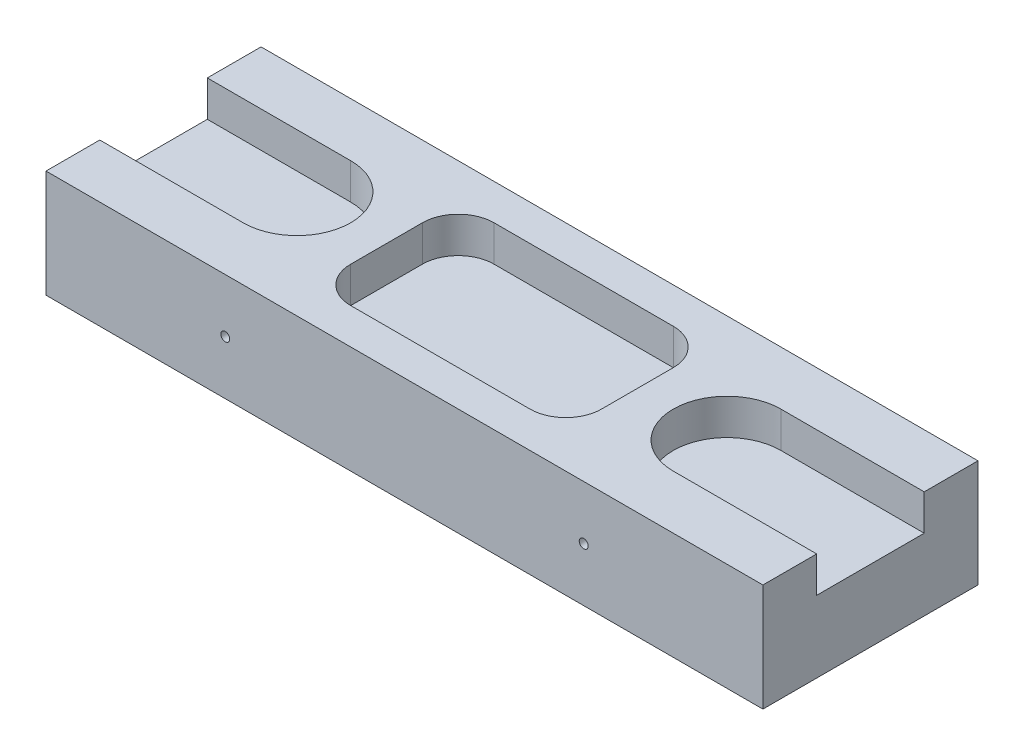
ISO-10303-21;
HEADER;
FILE_DESCRIPTION(('STEP AP214'),'2;1');
FILE_NAME('part.step','',(''),(''),'','','');
FILE_SCHEMA(('AUTOMOTIVE_DESIGN { 1 0 10303 214 1 1 1 1 }'));
ENDSEC;
DATA;
#1=APPLICATION_CONTEXT('core data for automotive mechanical design processes');
#2=APPLICATION_PROTOCOL_DEFINITION('international standard','automotive_design',2000,#1);
#3=PRODUCT_CONTEXT('',#1,'mechanical');
#4=PRODUCT('Part','Part','',(#3));
#5=PRODUCT_RELATED_PRODUCT_CATEGORY('part','',(#4));
#6=PRODUCT_DEFINITION_FORMATION('','',#4);
#7=PRODUCT_DEFINITION_CONTEXT('part definition',#1,'design');
#8=PRODUCT_DEFINITION('design','',#6,#7);
#9=PRODUCT_DEFINITION_SHAPE('','',#8);
#10=(LENGTH_UNIT() NAMED_UNIT(*) SI_UNIT(.MILLI.,.METRE.));
#11=(NAMED_UNIT(*) PLANE_ANGLE_UNIT() SI_UNIT($,.RADIAN.));
#12=(NAMED_UNIT(*) SI_UNIT($,.STERADIAN.) SOLID_ANGLE_UNIT());
#13=UNCERTAINTY_MEASURE_WITH_UNIT(LENGTH_MEASURE(1.E-05),#10,'distance_accuracy_value','');
#14=(GEOMETRIC_REPRESENTATION_CONTEXT(3) GLOBAL_UNCERTAINTY_ASSIGNED_CONTEXT((#13)) GLOBAL_UNIT_ASSIGNED_CONTEXT((#10,
#11,#12)) REPRESENTATION_CONTEXT('',''));
#15=CARTESIAN_POINT('',(0.,0.,0.));
#16=DIRECTION('',(0.,0.,1.));
#17=DIRECTION('',(1.,0.,0.));
#18=AXIS2_PLACEMENT_3D('',#15,#16,#17);
#19=CARTESIAN_POINT('',(0.,15.,0.));
#20=DIRECTION('',(1.,0.,0.));
#21=DIRECTION('',(0.,0.,-1.));
#22=AXIS2_PLACEMENT_3D('',#19,#20,#21);
#23=PLANE('',#22);
#24=DIRECTION('',(0.,0.,1.));
#25=VECTOR('',#24,1.);
#26=CARTESIAN_POINT('',(0.,10.,0.));
#27=LINE('',#26,#25);
#28=CARTESIAN_POINT('',(0.,10.,-22.5));
#29=VERTEX_POINT('',#28);
#30=CARTESIAN_POINT('',(0.,10.,-7.5));
#31=VERTEX_POINT('',#30);
#32=EDGE_CURVE('E11',#29,#31,#27,.T.);
#33=ORIENTED_EDGE('',*,*,#32,.F.);
#34=DIRECTION('',(0.,1.,0.));
#35=VECTOR('',#34,1.);
#36=CARTESIAN_POINT('',(0.,15.,-22.5));
#37=LINE('',#36,#35);
#38=CARTESIAN_POINT('',(0.,15.,-22.5));
#39=VERTEX_POINT('',#38);
#40=EDGE_CURVE('E300',#29,#39,#37,.T.);
#41=ORIENTED_EDGE('',*,*,#40,.T.);
#42=DIRECTION('',(0.,0.,1.));
#43=VECTOR('',#42,1.);
#44=CARTESIAN_POINT('',(0.,15.,0.));
#45=LINE('',#44,#43);
#46=CARTESIAN_POINT('',(0.,15.,-30.));
#47=VERTEX_POINT('',#46);
#48=EDGE_CURVE('E304',#47,#39,#45,.T.);
#49=ORIENTED_EDGE('',*,*,#48,.F.);
#50=DIRECTION('',(0.,-1.,0.));
#51=VECTOR('',#50,1.);
#52=CARTESIAN_POINT('',(0.,15.,-30.));
#53=LINE('',#52,#51);
#54=CARTESIAN_POINT('',(0.,0.,-30.));
#55=VERTEX_POINT('',#54);
#56=EDGE_CURVE('E316',#47,#55,#53,.T.);
#57=ORIENTED_EDGE('',*,*,#56,.T.);
#58=DIRECTION('',(0.,0.,1.));
#59=VECTOR('',#58,1.);
#60=CARTESIAN_POINT('',(0.,0.,0.));
#61=LINE('',#60,#59);
#62=CARTESIAN_POINT('',(0.,0.,0.));
#63=VERTEX_POINT('',#62);
#64=EDGE_CURVE('E303',#55,#63,#61,.T.);
#65=ORIENTED_EDGE('',*,*,#64,.T.);
#66=DIRECTION('',(0.,-1.,0.));
#67=VECTOR('',#66,1.);
#68=CARTESIAN_POINT('',(0.,15.,0.));
#69=LINE('',#68,#67);
#70=CARTESIAN_POINT('',(0.,15.,0.));
#71=VERTEX_POINT('',#70);
#72=EDGE_CURVE('E333',#71,#63,#69,.T.);
#73=ORIENTED_EDGE('',*,*,#72,.F.);
#74=CARTESIAN_POINT('',(0.,15.,-7.50000000000001));
#75=VERTEX_POINT('',#74);
#76=EDGE_CURVE('E308',#75,#71,#45,.T.);
#77=ORIENTED_EDGE('',*,*,#76,.F.);
#78=DIRECTION('',(0.,-1.,0.));
#79=VECTOR('',#78,1.);
#80=CARTESIAN_POINT('',(0.,15.,-7.5));
#81=LINE('',#80,#79);
#82=EDGE_CURVE('E297',#75,#31,#81,.T.);
#83=ORIENTED_EDGE('',*,*,#82,.T.);
#84=EDGE_LOOP('',(#33,#41,#49,#57,#65,#73,#77,#83));
#85=FACE_BOUND('',#84,.T.);
#86=ADVANCED_FACE('F39',(#85),#23,.F.);
#87=CARTESIAN_POINT('',(0.,15.,0.));
#88=DIRECTION('',(0.,0.,-1.));
#89=DIRECTION('',(-1.,0.,0.));
#90=AXIS2_PLACEMENT_3D('',#87,#88,#89);
#91=PLANE('',#90);
#92=CARTESIAN_POINT('',(25.,7.5,0.));
#93=DIRECTION('',(0.,0.,1.));
#94=DIRECTION('',(1.,0.,0.));
#95=AXIS2_PLACEMENT_3D('',#92,#93,#94);
#96=CIRCLE('',#95,0.624999999999999);
#97=CARTESIAN_POINT('',(25.625,7.5,0.));
#98=VERTEX_POINT('',#97);
#99=EDGE_CURVE('E246',#98,#98,#96,.T.);
#100=ORIENTED_EDGE('',*,*,#99,.F.);
#101=EDGE_LOOP('',(#100));
#102=FACE_BOUND('',#101,.T.);
#103=CARTESIAN_POINT('',(75.,7.5,0.));
#104=DIRECTION('',(0.,0.,1.));
#105=DIRECTION('',(1.,0.,0.));
#106=AXIS2_PLACEMENT_3D('',#103,#104,#105);
#107=CIRCLE('',#106,0.625000000000006);
#108=CARTESIAN_POINT('',(75.625,7.5,0.));
#109=VERTEX_POINT('',#108);
#110=EDGE_CURVE('E250',#109,#109,#107,.T.);
#111=ORIENTED_EDGE('',*,*,#110,.F.);
#112=EDGE_LOOP('',(#111));
#113=FACE_BOUND('',#112,.T.);
#114=DIRECTION('',(1.,0.,0.));
#115=VECTOR('',#114,1.);
#116=CARTESIAN_POINT('',(0.,0.,0.));
#117=LINE('',#116,#115);
#118=CARTESIAN_POINT('',(100.,0.,0.));
#119=VERTEX_POINT('',#118);
#120=EDGE_CURVE('E319',#63,#119,#117,.T.);
#121=ORIENTED_EDGE('',*,*,#120,.T.);
#122=DIRECTION('',(0.,-1.,0.));
#123=VECTOR('',#122,1.);
#124=CARTESIAN_POINT('',(100.,15.,0.));
#125=LINE('',#124,#123);
#126=CARTESIAN_POINT('',(100.,15.,0.));
#127=VERTEX_POINT('',#126);
#128=EDGE_CURVE('E330',#127,#119,#125,.T.);
#129=ORIENTED_EDGE('',*,*,#128,.F.);
#130=DIRECTION('',(1.,0.,0.));
#131=VECTOR('',#130,1.);
#132=CARTESIAN_POINT('',(0.,15.,0.));
#133=LINE('',#132,#131);
#134=EDGE_CURVE('E307',#71,#127,#133,.T.);
#135=ORIENTED_EDGE('',*,*,#134,.F.);
#136=ORIENTED_EDGE('',*,*,#72,.T.);
#137=EDGE_LOOP('',(#121,#129,#135,#136));
#138=FACE_BOUND('',#137,.T.);
#139=ADVANCED_FACE('F389',(#102,#113,#138),#91,.F.);
#140=CARTESIAN_POINT('',(100.,15.,0.));
#141=DIRECTION('',(-1.,0.,0.));
#142=DIRECTION('',(0.,0.,1.));
#143=AXIS2_PLACEMENT_3D('',#140,#141,#142);
#144=PLANE('',#143);
#145=DIRECTION('',(0.,0.,1.));
#146=VECTOR('',#145,1.);
#147=CARTESIAN_POINT('',(100.,10.,0.));
#148=LINE('',#147,#146);
#149=CARTESIAN_POINT('',(100.,10.,-22.4999999999999));
#150=VERTEX_POINT('',#149);
#151=CARTESIAN_POINT('',(100.,10.,-7.49999999999991));
#152=VERTEX_POINT('',#151);
#153=EDGE_CURVE('E46',#150,#152,#148,.T.);
#154=ORIENTED_EDGE('',*,*,#153,.T.);
#155=DIRECTION('',(0.,1.,0.));
#156=VECTOR('',#155,1.);
#157=CARTESIAN_POINT('',(100.,15.,-7.49999999999991));
#158=LINE('',#157,#156);
#159=CARTESIAN_POINT('',(100.,15.,-7.49999999999991));
#160=VERTEX_POINT('',#159);
#161=EDGE_CURVE('E294',#152,#160,#158,.T.);
#162=ORIENTED_EDGE('',*,*,#161,.T.);
#163=DIRECTION('',(0.,0.,-1.));
#164=VECTOR('',#163,1.);
#165=CARTESIAN_POINT('',(100.,15.,0.));
#166=LINE('',#165,#164);
#167=EDGE_CURVE('E311',#127,#160,#166,.T.);
#168=ORIENTED_EDGE('',*,*,#167,.F.);
#169=ORIENTED_EDGE('',*,*,#128,.T.);
#170=DIRECTION('',(0.,0.,-1.));
#171=VECTOR('',#170,1.);
#172=CARTESIAN_POINT('',(100.,0.,0.));
#173=LINE('',#172,#171);
#174=CARTESIAN_POINT('',(100.,0.,-30.));
#175=VERTEX_POINT('',#174);
#176=EDGE_CURVE('E321',#119,#175,#173,.T.);
#177=ORIENTED_EDGE('',*,*,#176,.T.);
#178=DIRECTION('',(0.,-1.,0.));
#179=VECTOR('',#178,1.);
#180=CARTESIAN_POINT('',(100.,15.,-30.));
#181=LINE('',#180,#179);
#182=CARTESIAN_POINT('',(100.,15.,-30.));
#183=VERTEX_POINT('',#182);
#184=EDGE_CURVE('E327',#183,#175,#181,.T.);
#185=ORIENTED_EDGE('',*,*,#184,.F.);
#186=CARTESIAN_POINT('',(100.,15.,-22.4999999999999));
#187=VERTEX_POINT('',#186);
#188=EDGE_CURVE('E310',#187,#183,#166,.T.);
#189=ORIENTED_EDGE('',*,*,#188,.F.);
#190=DIRECTION('',(0.,-1.,0.));
#191=VECTOR('',#190,1.);
#192=CARTESIAN_POINT('',(100.,15.,-22.4999999999999));
#193=LINE('',#192,#191);
#194=EDGE_CURVE('E61',#187,#150,#193,.T.);
#195=ORIENTED_EDGE('',*,*,#194,.T.);
#196=EDGE_LOOP('',(#154,#162,#168,#169,#177,#185,#189,#195));
#197=FACE_BOUND('',#196,.T.);
#198=ADVANCED_FACE('F342',(#197),#144,.F.);
#199=CARTESIAN_POINT('',(0.,15.,-30.));
#200=DIRECTION('',(0.,0.,1.));
#201=DIRECTION('',(1.,0.,0.));
#202=AXIS2_PLACEMENT_3D('',#199,#200,#201);
#203=PLANE('',#202);
#204=CARTESIAN_POINT('',(25.,7.5,-30.));
#205=DIRECTION('',(0.,0.,1.));
#206=DIRECTION('',(1.,0.,0.));
#207=AXIS2_PLACEMENT_3D('',#204,#205,#206);
#208=CIRCLE('',#207,0.624999999999999);
#209=CARTESIAN_POINT('',(25.625,7.5,-30.));
#210=VERTEX_POINT('',#209);
#211=EDGE_CURVE('E249',#210,#210,#208,.F.);
#212=ORIENTED_EDGE('',*,*,#211,.F.);
#213=EDGE_LOOP('',(#212));
#214=FACE_BOUND('',#213,.T.);
#215=CARTESIAN_POINT('',(75.,7.5,-30.));
#216=DIRECTION('',(0.,0.,1.));
#217=DIRECTION('',(1.,0.,0.));
#218=AXIS2_PLACEMENT_3D('',#215,#216,#217);
#219=CIRCLE('',#218,0.625000000000006);
#220=CARTESIAN_POINT('',(75.625,7.5,-30.));
#221=VERTEX_POINT('',#220);
#222=EDGE_CURVE('E234',#221,#221,#219,.F.);
#223=ORIENTED_EDGE('',*,*,#222,.F.);
#224=EDGE_LOOP('',(#223));
#225=FACE_BOUND('',#224,.T.);
#226=DIRECTION('',(-1.,0.,0.));
#227=VECTOR('',#226,1.);
#228=CARTESIAN_POINT('',(0.,0.,-30.));
#229=LINE('',#228,#227);
#230=EDGE_CURVE('E323',#175,#55,#229,.T.);
#231=ORIENTED_EDGE('',*,*,#230,.T.);
#232=ORIENTED_EDGE('',*,*,#56,.F.);
#233=DIRECTION('',(-1.,0.,0.));
#234=VECTOR('',#233,1.);
#235=CARTESIAN_POINT('',(0.,15.,-30.));
#236=LINE('',#235,#234);
#237=EDGE_CURVE('E314',#183,#47,#236,.T.);
#238=ORIENTED_EDGE('',*,*,#237,.F.);
#239=ORIENTED_EDGE('',*,*,#184,.T.);
#240=EDGE_LOOP('',(#231,#232,#238,#239));
#241=FACE_BOUND('',#240,.T.);
#242=ADVANCED_FACE('F370',(#214,#225,#241),#203,.F.);
#243=CARTESIAN_POINT('',(0.,15.,0.));
#244=DIRECTION('',(0.,-1.,0.));
#245=DIRECTION('',(0.,0.,-1.));
#246=AXIS2_PLACEMENT_3D('',#243,#244,#245);
#247=PLANE('',#246);
#248=DIRECTION('',(1.,0.,0.));
#249=VECTOR('',#248,1.);
#250=CARTESIAN_POINT('',(37.5,15.,-5.));
#251=LINE('',#250,#249);
#252=CARTESIAN_POINT('',(37.5,15.,-5.));
#253=VERTEX_POINT('',#252);
#254=CARTESIAN_POINT('',(62.4999999999999,15.,-5.));
#255=VERTEX_POINT('',#254);
#256=EDGE_CURVE('E216',#253,#255,#251,.T.);
#257=ORIENTED_EDGE('',*,*,#256,.F.);
#258=CARTESIAN_POINT('',(37.5,15.,-10.));
#259=DIRECTION('',(0.,1.,0.));
#260=DIRECTION('',(0.,0.,1.));
#261=AXIS2_PLACEMENT_3D('',#258,#259,#260);
#262=CIRCLE('',#261,5.);
#263=CARTESIAN_POINT('',(32.5,15.,-10.));
#264=VERTEX_POINT('',#263);
#265=EDGE_CURVE('E53',#264,#253,#262,.T.);
#266=ORIENTED_EDGE('',*,*,#265,.F.);
#267=DIRECTION('',(0.,0.,1.));
#268=VECTOR('',#267,1.);
#269=CARTESIAN_POINT('',(32.5,15.,-20.));
#270=LINE('',#269,#268);
#271=CARTESIAN_POINT('',(32.5,15.,-20.));
#272=VERTEX_POINT('',#271);
#273=EDGE_CURVE('E196',#272,#264,#270,.T.);
#274=ORIENTED_EDGE('',*,*,#273,.F.);
#275=CARTESIAN_POINT('',(37.5,15.,-20.));
#276=DIRECTION('',(0.,1.,0.));
#277=DIRECTION('',(0.,0.,1.));
#278=AXIS2_PLACEMENT_3D('',#275,#276,#277);
#279=CIRCLE('',#278,5.);
#280=CARTESIAN_POINT('',(37.5,15.,-25.));
#281=VERTEX_POINT('',#280);
#282=EDGE_CURVE('E199',#281,#272,#279,.T.);
#283=ORIENTED_EDGE('',*,*,#282,.F.);
#284=DIRECTION('',(-1.,0.,0.));
#285=VECTOR('',#284,1.);
#286=CARTESIAN_POINT('',(37.5,15.,-25.));
#287=LINE('',#286,#285);
#288=CARTESIAN_POINT('',(62.4999999999999,15.,-25.));
#289=VERTEX_POINT('',#288);
#290=EDGE_CURVE('E227',#289,#281,#287,.T.);
#291=ORIENTED_EDGE('',*,*,#290,.F.);
#292=CARTESIAN_POINT('',(62.5,15.,-20.));
#293=DIRECTION('',(0.,1.,0.));
#294=DIRECTION('',(0.,0.,-1.));
#295=AXIS2_PLACEMENT_3D('',#292,#293,#294);
#296=CIRCLE('',#295,5.);
#297=CARTESIAN_POINT('',(67.5,15.,-20.));
#298=VERTEX_POINT('',#297);
#299=EDGE_CURVE('E224',#298,#289,#296,.T.);
#300=ORIENTED_EDGE('',*,*,#299,.F.);
#301=DIRECTION('',(0.,0.,-1.));
#302=VECTOR('',#301,1.);
#303=CARTESIAN_POINT('',(67.5,15.,-20.));
#304=LINE('',#303,#302);
#305=CARTESIAN_POINT('',(67.5,15.,-10.));
#306=VERTEX_POINT('',#305);
#307=EDGE_CURVE('E221',#306,#298,#304,.T.);
#308=ORIENTED_EDGE('',*,*,#307,.F.);
#309=CARTESIAN_POINT('',(62.5,15.,-10.));
#310=DIRECTION('',(0.,1.,0.));
#311=DIRECTION('',(0.,0.,1.));
#312=AXIS2_PLACEMENT_3D('',#309,#310,#311);
#313=CIRCLE('',#312,5.);
#314=EDGE_CURVE('E218',#255,#306,#313,.T.);
#315=ORIENTED_EDGE('',*,*,#314,.F.);
#316=EDGE_LOOP('',(#257,#266,#274,#283,#291,#300,#308,#315));
#317=FACE_BOUND('',#316,.T.);
#318=ORIENTED_EDGE('',*,*,#48,.T.);
#319=DIRECTION('',(-1.,0.,0.));
#320=VECTOR('',#319,1.);
#321=CARTESIAN_POINT('',(-20.,15.,-22.5));
#322=LINE('',#321,#320);
#323=CARTESIAN_POINT('',(20.,15.,-22.5));
#324=VERTEX_POINT('',#323);
#325=EDGE_CURVE('E261',#324,#39,#322,.T.);
#326=ORIENTED_EDGE('',*,*,#325,.F.);
#327=CARTESIAN_POINT('',(20.,15.,-15.));
#328=DIRECTION('',(0.,1.,0.));
#329=DIRECTION('',(0.,0.,1.));
#330=AXIS2_PLACEMENT_3D('',#327,#328,#329);
#331=CIRCLE('',#330,7.5);
#332=CARTESIAN_POINT('',(20.,15.,-7.50000000000001));
#333=VERTEX_POINT('',#332);
#334=EDGE_CURVE('E268',#333,#324,#331,.T.);
#335=ORIENTED_EDGE('',*,*,#334,.F.);
#336=DIRECTION('',(-1.,0.,0.));
#337=VECTOR('',#336,1.);
#338=CARTESIAN_POINT('',(0.,15.,-7.5));
#339=LINE('',#338,#337);
#340=EDGE_CURVE('E338',#333,#75,#339,.T.);
#341=ORIENTED_EDGE('',*,*,#340,.T.);
#342=ORIENTED_EDGE('',*,*,#76,.T.);
#343=ORIENTED_EDGE('',*,*,#134,.T.);
#344=ORIENTED_EDGE('',*,*,#167,.T.);
#345=DIRECTION('',(1.,0.,0.));
#346=VECTOR('',#345,1.);
#347=CARTESIAN_POINT('',(120.,15.,-7.49999999999987));
#348=LINE('',#347,#346);
#349=CARTESIAN_POINT('',(80.,15.,-7.49999999999995));
#350=VERTEX_POINT('',#349);
#351=EDGE_CURVE('E282',#350,#160,#348,.T.);
#352=ORIENTED_EDGE('',*,*,#351,.F.);
#353=CARTESIAN_POINT('',(80.,15.,-15.));
#354=DIRECTION('',(0.,1.,0.));
#355=DIRECTION('',(0.,0.,-1.));
#356=AXIS2_PLACEMENT_3D('',#353,#354,#355);
#357=CIRCLE('',#356,7.5);
#358=CARTESIAN_POINT('',(80.,15.,-22.5));
#359=VERTEX_POINT('',#358);
#360=EDGE_CURVE('E271',#359,#350,#357,.T.);
#361=ORIENTED_EDGE('',*,*,#360,.F.);
#362=DIRECTION('',(1.,0.,0.));
#363=VECTOR('',#362,1.);
#364=CARTESIAN_POINT('',(0.,15.,-22.5000000000001));
#365=LINE('',#364,#363);
#366=EDGE_CURVE('E336',#359,#187,#365,.T.);
#367=ORIENTED_EDGE('',*,*,#366,.T.);
#368=ORIENTED_EDGE('',*,*,#188,.T.);
#369=ORIENTED_EDGE('',*,*,#237,.T.);
#370=EDGE_LOOP('',(#318,#326,#335,#341,#342,#343,#344,#352,#361,#367,#368,#369));
#371=FACE_BOUND('',#370,.T.);
#372=ADVANCED_FACE('F358',(#317,#371),#247,.F.);
#373=CARTESIAN_POINT('',(0.,0.,0.));
#374=DIRECTION('',(0.,-1.,0.));
#375=DIRECTION('',(0.,0.,-1.));
#376=AXIS2_PLACEMENT_3D('',#373,#374,#375);
#377=PLANE('',#376);
#378=ORIENTED_EDGE('',*,*,#64,.F.);
#379=ORIENTED_EDGE('',*,*,#230,.F.);
#380=ORIENTED_EDGE('',*,*,#176,.F.);
#381=ORIENTED_EDGE('',*,*,#120,.F.);
#382=EDGE_LOOP('',(#378,#379,#380,#381));
#383=FACE_BOUND('',#382,.T.);
#384=ADVANCED_FACE('F367',(#383),#377,.T.);
#385=CARTESIAN_POINT('',(120.,10.,-14.9999999999999));
#386=DIRECTION('',(0.,-1.,0.));
#387=DIRECTION('',(0.,0.,-1.));
#388=AXIS2_PLACEMENT_3D('',#385,#386,#387);
#389=PLANE('',#388);
#390=DIRECTION('',(-1.,0.,0.));
#391=VECTOR('',#390,1.);
#392=CARTESIAN_POINT('',(120.,10.,-22.4999999999999));
#393=LINE('',#392,#391);
#394=CARTESIAN_POINT('',(80.,10.,-22.5));
#395=VERTEX_POINT('',#394);
#396=EDGE_CURVE('E284',#150,#395,#393,.T.);
#397=ORIENTED_EDGE('',*,*,#396,.T.);
#398=CARTESIAN_POINT('',(80.,10.,-15.));
#399=DIRECTION('',(0.,1.,0.));
#400=DIRECTION('',(0.,0.,-1.));
#401=AXIS2_PLACEMENT_3D('',#398,#399,#400);
#402=CIRCLE('',#401,7.5);
#403=CARTESIAN_POINT('',(80.,10.,-7.49999999999995));
#404=VERTEX_POINT('',#403);
#405=EDGE_CURVE('E289',#395,#404,#402,.T.);
#406=ORIENTED_EDGE('',*,*,#405,.T.);
#407=DIRECTION('',(1.,0.,0.));
#408=VECTOR('',#407,1.);
#409=CARTESIAN_POINT('',(120.,10.,-7.49999999999987));
#410=LINE('',#409,#408);
#411=EDGE_CURVE('E280',#404,#152,#410,.T.);
#412=ORIENTED_EDGE('',*,*,#411,.T.);
#413=ORIENTED_EDGE('',*,*,#153,.F.);
#414=EDGE_LOOP('',(#397,#406,#412,#413));
#415=FACE_BOUND('',#414,.T.);
#416=ADVANCED_FACE('F346',(#415),#389,.F.);
#417=CARTESIAN_POINT('',(120.,10.,-7.49999999999987));
#418=DIRECTION('',(0.,0.,1.));
#419=DIRECTION('',(1.,0.,0.));
#420=AXIS2_PLACEMENT_3D('',#417,#418,#419);
#421=PLANE('',#420);
#422=ORIENTED_EDGE('',*,*,#411,.F.);
#423=DIRECTION('',(0.,1.,0.));
#424=VECTOR('',#423,1.);
#425=CARTESIAN_POINT('',(80.,10.,-7.49999999999995));
#426=LINE('',#425,#424);
#427=EDGE_CURVE('E253',#404,#350,#426,.T.);
#428=ORIENTED_EDGE('',*,*,#427,.T.);
#429=ORIENTED_EDGE('',*,*,#351,.T.);
#430=ORIENTED_EDGE('',*,*,#161,.F.);
#431=EDGE_LOOP('',(#422,#428,#429,#430));
#432=FACE_BOUND('',#431,.T.);
#433=ADVANCED_FACE('F355',(#432),#421,.F.);
#434=CARTESIAN_POINT('',(120.,10.,-22.4999999999999));
#435=DIRECTION('',(0.,0.,-1.));
#436=DIRECTION('',(-1.,0.,0.));
#437=AXIS2_PLACEMENT_3D('',#434,#435,#436);
#438=PLANE('',#437);
#439=ORIENTED_EDGE('',*,*,#366,.F.);
#440=DIRECTION('',(0.,1.,0.));
#441=VECTOR('',#440,1.);
#442=CARTESIAN_POINT('',(80.,10.,-22.5));
#443=LINE('',#442,#441);
#444=EDGE_CURVE('E277',#395,#359,#443,.T.);
#445=ORIENTED_EDGE('',*,*,#444,.F.);
#446=ORIENTED_EDGE('',*,*,#396,.F.);
#447=ORIENTED_EDGE('',*,*,#194,.F.);
#448=EDGE_LOOP('',(#439,#445,#446,#447));
#449=FACE_BOUND('',#448,.T.);
#450=ADVANCED_FACE('F349',(#449),#438,.F.);
#451=CARTESIAN_POINT('',(80.,10.,-15.));
#452=DIRECTION('',(0.,1.,0.));
#453=DIRECTION('',(0.,0.,1.));
#454=AXIS2_PLACEMENT_3D('',#451,#452,#453);
#455=CYLINDRICAL_SURFACE('',#454,7.5);
#456=ORIENTED_EDGE('',*,*,#360,.T.);
#457=ORIENTED_EDGE('',*,*,#427,.F.);
#458=ORIENTED_EDGE('',*,*,#405,.F.);
#459=ORIENTED_EDGE('',*,*,#444,.T.);
#460=EDGE_LOOP('',(#456,#457,#458,#459));
#461=FACE_BOUND('',#460,.T.);
#462=ADVANCED_FACE('F353',(#461),#455,.F.);
#463=CARTESIAN_POINT('',(-20.,10.,-15.));
#464=DIRECTION('',(0.,1.,0.));
#465=DIRECTION('',(0.,0.,1.));
#466=AXIS2_PLACEMENT_3D('',#463,#464,#465);
#467=PLANE('',#466);
#468=ORIENTED_EDGE('',*,*,#32,.T.);
#469=DIRECTION('',(1.,0.,0.));
#470=VECTOR('',#469,1.);
#471=CARTESIAN_POINT('',(-20.,10.,-7.5));
#472=LINE('',#471,#470);
#473=CARTESIAN_POINT('',(20.,10.,-7.50000000000001));
#474=VERTEX_POINT('',#473);
#475=EDGE_CURVE('E258',#31,#474,#472,.T.);
#476=ORIENTED_EDGE('',*,*,#475,.T.);
#477=CARTESIAN_POINT('',(20.,10.,-15.));
#478=DIRECTION('',(0.,1.,0.));
#479=DIRECTION('',(0.,0.,1.));
#480=AXIS2_PLACEMENT_3D('',#477,#478,#479);
#481=CIRCLE('',#480,7.5);
#482=CARTESIAN_POINT('',(20.,10.,-22.5));
#483=VERTEX_POINT('',#482);
#484=EDGE_CURVE('E260',#474,#483,#481,.T.);
#485=ORIENTED_EDGE('',*,*,#484,.T.);
#486=DIRECTION('',(-1.,0.,0.));
#487=VECTOR('',#486,1.);
#488=CARTESIAN_POINT('',(-20.,10.,-22.5));
#489=LINE('',#488,#487);
#490=EDGE_CURVE('E264',#483,#29,#489,.T.);
#491=ORIENTED_EDGE('',*,*,#490,.T.);
#492=EDGE_LOOP('',(#468,#476,#485,#491));
#493=FACE_BOUND('',#492,.T.);
#494=ADVANCED_FACE('F415',(#493),#467,.T.);
#495=CARTESIAN_POINT('',(-20.,10.,-22.5));
#496=DIRECTION('',(0.,0.,-1.));
#497=DIRECTION('',(-1.,0.,0.));
#498=AXIS2_PLACEMENT_3D('',#495,#496,#497);
#499=PLANE('',#498);
#500=ORIENTED_EDGE('',*,*,#490,.F.);
#501=DIRECTION('',(0.,1.,0.));
#502=VECTOR('',#501,1.);
#503=CARTESIAN_POINT('',(20.,10.,-22.5));
#504=LINE('',#503,#502);
#505=EDGE_CURVE('E273',#483,#324,#504,.T.);
#506=ORIENTED_EDGE('',*,*,#505,.T.);
#507=ORIENTED_EDGE('',*,*,#325,.T.);
#508=ORIENTED_EDGE('',*,*,#40,.F.);
#509=EDGE_LOOP('',(#500,#506,#507,#508));
#510=FACE_BOUND('',#509,.T.);
#511=ADVANCED_FACE('F380',(#510),#499,.F.);
#512=CARTESIAN_POINT('',(-20.,10.,-7.5));
#513=DIRECTION('',(0.,0.,1.));
#514=DIRECTION('',(1.,0.,0.));
#515=AXIS2_PLACEMENT_3D('',#512,#513,#514);
#516=PLANE('',#515);
#517=ORIENTED_EDGE('',*,*,#340,.F.);
#518=DIRECTION('',(0.,1.,0.));
#519=VECTOR('',#518,1.);
#520=CARTESIAN_POINT('',(20.,10.,-7.50000000000001));
#521=LINE('',#520,#519);
#522=EDGE_CURVE('E267',#474,#333,#521,.T.);
#523=ORIENTED_EDGE('',*,*,#522,.F.);
#524=ORIENTED_EDGE('',*,*,#475,.F.);
#525=ORIENTED_EDGE('',*,*,#82,.F.);
#526=EDGE_LOOP('',(#517,#523,#524,#525));
#527=FACE_BOUND('',#526,.T.);
#528=ADVANCED_FACE('F387',(#527),#516,.F.);
#529=CARTESIAN_POINT('',(20.,10.,-15.));
#530=DIRECTION('',(0.,1.,0.));
#531=DIRECTION('',(0.,0.,1.));
#532=AXIS2_PLACEMENT_3D('',#529,#530,#531);
#533=CYLINDRICAL_SURFACE('',#532,7.5);
#534=ORIENTED_EDGE('',*,*,#334,.T.);
#535=ORIENTED_EDGE('',*,*,#505,.F.);
#536=ORIENTED_EDGE('',*,*,#484,.F.);
#537=ORIENTED_EDGE('',*,*,#522,.T.);
#538=EDGE_LOOP('',(#534,#535,#536,#537));
#539=FACE_BOUND('',#538,.T.);
#540=ADVANCED_FACE('F383',(#539),#533,.F.);
#541=CARTESIAN_POINT('',(75.,7.5,-31.7677669529664));
#542=DIRECTION('',(0.,0.,1.));
#543=DIRECTION('',(1.,0.,0.));
#544=AXIS2_PLACEMENT_3D('',#541,#542,#543);
#545=CYLINDRICAL_SURFACE('',#544,0.625000000000006);
#546=ORIENTED_EDGE('',*,*,#222,.T.);
#547=EDGE_LOOP('',(#546));
#548=FACE_BOUND('',#547,.T.);
#549=ORIENTED_EDGE('',*,*,#110,.T.);
#550=EDGE_LOOP('',(#549));
#551=FACE_BOUND('',#550,.T.);
#552=ADVANCED_FACE('F421',(#548,#551),#545,.F.);
#553=CARTESIAN_POINT('',(25.,7.5,-31.7677669529664));
#554=DIRECTION('',(0.,0.,1.));
#555=DIRECTION('',(1.,0.,0.));
#556=AXIS2_PLACEMENT_3D('',#553,#554,#555);
#557=CYLINDRICAL_SURFACE('',#556,0.624999999999999);
#558=ORIENTED_EDGE('',*,*,#211,.T.);
#559=EDGE_LOOP('',(#558));
#560=FACE_BOUND('',#559,.T.);
#561=ORIENTED_EDGE('',*,*,#99,.T.);
#562=EDGE_LOOP('',(#561));
#563=FACE_BOUND('',#562,.T.);
#564=ADVANCED_FACE('F429',(#560,#563),#557,.F.);
#565=CARTESIAN_POINT('',(37.5,10.,-10.));
#566=DIRECTION('',(0.,1.,0.));
#567=DIRECTION('',(0.,0.,1.));
#568=AXIS2_PLACEMENT_3D('',#565,#566,#567);
#569=CYLINDRICAL_SURFACE('',#568,5.);
#570=ORIENTED_EDGE('',*,*,#265,.T.);
#571=DIRECTION('',(0.,1.,0.));
#572=VECTOR('',#571,1.);
#573=CARTESIAN_POINT('',(37.5,10.,-5.));
#574=LINE('',#573,#572);
#575=CARTESIAN_POINT('',(37.5,10.,-5.));
#576=VERTEX_POINT('',#575);
#577=EDGE_CURVE('E173',#576,#253,#574,.T.);
#578=ORIENTED_EDGE('',*,*,#577,.F.);
#579=CARTESIAN_POINT('',(37.5,10.,-10.));
#580=DIRECTION('',(0.,1.,0.));
#581=DIRECTION('',(0.,0.,1.));
#582=AXIS2_PLACEMENT_3D('',#579,#580,#581);
#583=CIRCLE('',#582,5.);
#584=CARTESIAN_POINT('',(32.5,10.,-10.));
#585=VERTEX_POINT('',#584);
#586=EDGE_CURVE('E177',#585,#576,#583,.T.);
#587=ORIENTED_EDGE('',*,*,#586,.F.);
#588=DIRECTION('',(0.,1.,0.));
#589=VECTOR('',#588,1.);
#590=CARTESIAN_POINT('',(32.5,10.,-10.));
#591=LINE('',#590,#589);
#592=EDGE_CURVE('E232',#585,#264,#591,.T.);
#593=ORIENTED_EDGE('',*,*,#592,.T.);
#594=EDGE_LOOP('',(#570,#578,#587,#593));
#595=FACE_BOUND('',#594,.T.);
#596=ADVANCED_FACE('F175',(#595),#569,.F.);
#597=CARTESIAN_POINT('',(32.5,10.,-20.));
#598=DIRECTION('',(-1.,0.,0.));
#599=DIRECTION('',(0.,0.,1.));
#600=AXIS2_PLACEMENT_3D('',#597,#598,#599);
#601=PLANE('',#600);
#602=ORIENTED_EDGE('',*,*,#273,.T.);
#603=ORIENTED_EDGE('',*,*,#592,.F.);
#604=DIRECTION('',(0.,0.,1.));
#605=VECTOR('',#604,1.);
#606=CARTESIAN_POINT('',(32.5,10.,-20.));
#607=LINE('',#606,#605);
#608=CARTESIAN_POINT('',(32.5,10.,-20.));
#609=VERTEX_POINT('',#608);
#610=EDGE_CURVE('E183',#609,#585,#607,.T.);
#611=ORIENTED_EDGE('',*,*,#610,.F.);
#612=DIRECTION('',(0.,1.,0.));
#613=VECTOR('',#612,1.);
#614=CARTESIAN_POINT('',(32.5,10.,-20.));
#615=LINE('',#614,#613);
#616=EDGE_CURVE('E235',#609,#272,#615,.T.);
#617=ORIENTED_EDGE('',*,*,#616,.T.);
#618=EDGE_LOOP('',(#602,#603,#611,#617));
#619=FACE_BOUND('',#618,.T.);
#620=ADVANCED_FACE('F436',(#619),#601,.F.);
#621=CARTESIAN_POINT('',(37.5,10.,-20.));
#622=DIRECTION('',(0.,1.,0.));
#623=DIRECTION('',(0.,0.,1.));
#624=AXIS2_PLACEMENT_3D('',#621,#622,#623);
#625=CYLINDRICAL_SURFACE('',#624,5.);
#626=ORIENTED_EDGE('',*,*,#282,.T.);
#627=ORIENTED_EDGE('',*,*,#616,.F.);
#628=CARTESIAN_POINT('',(37.5,10.,-20.));
#629=DIRECTION('',(0.,1.,0.));
#630=DIRECTION('',(0.,0.,1.));
#631=AXIS2_PLACEMENT_3D('',#628,#629,#630);
#632=CIRCLE('',#631,5.);
#633=CARTESIAN_POINT('',(37.5,10.,-25.));
#634=VERTEX_POINT('',#633);
#635=EDGE_CURVE('E212',#634,#609,#632,.T.);
#636=ORIENTED_EDGE('',*,*,#635,.F.);
#637=DIRECTION('',(0.,1.,0.));
#638=VECTOR('',#637,1.);
#639=CARTESIAN_POINT('',(37.5,10.,-25.));
#640=LINE('',#639,#638);
#641=EDGE_CURVE('E237',#634,#281,#640,.T.);
#642=ORIENTED_EDGE('',*,*,#641,.T.);
#643=EDGE_LOOP('',(#626,#627,#636,#642));
#644=FACE_BOUND('',#643,.T.);
#645=ADVANCED_FACE('F454',(#644),#625,.F.);
#646=CARTESIAN_POINT('',(37.5,10.,-25.));
#647=DIRECTION('',(0.,0.,-1.));
#648=DIRECTION('',(-1.,0.,0.));
#649=AXIS2_PLACEMENT_3D('',#646,#647,#648);
#650=PLANE('',#649);
#651=ORIENTED_EDGE('',*,*,#290,.T.);
#652=ORIENTED_EDGE('',*,*,#641,.F.);
#653=DIRECTION('',(-1.,0.,0.));
#654=VECTOR('',#653,1.);
#655=CARTESIAN_POINT('',(37.5,10.,-25.));
#656=LINE('',#655,#654);
#657=CARTESIAN_POINT('',(62.4999999999999,10.,-25.));
#658=VERTEX_POINT('',#657);
#659=EDGE_CURVE('E209',#658,#634,#656,.T.);
#660=ORIENTED_EDGE('',*,*,#659,.F.);
#661=DIRECTION('',(0.,1.,0.));
#662=VECTOR('',#661,1.);
#663=CARTESIAN_POINT('',(62.4999999999999,10.,-25.));
#664=LINE('',#663,#662);
#665=EDGE_CURVE('E239',#658,#289,#664,.T.);
#666=ORIENTED_EDGE('',*,*,#665,.T.);
#667=EDGE_LOOP('',(#651,#652,#660,#666));
#668=FACE_BOUND('',#667,.T.);
#669=ADVANCED_FACE('F450',(#668),#650,.F.);
#670=CARTESIAN_POINT('',(62.5,10.,-20.));
#671=DIRECTION('',(0.,1.,0.));
#672=DIRECTION('',(0.,0.,1.));
#673=AXIS2_PLACEMENT_3D('',#670,#671,#672);
#674=CYLINDRICAL_SURFACE('',#673,5.);
#675=ORIENTED_EDGE('',*,*,#299,.T.);
#676=ORIENTED_EDGE('',*,*,#665,.F.);
#677=CARTESIAN_POINT('',(62.5,10.,-20.));
#678=DIRECTION('',(0.,1.,0.));
#679=DIRECTION('',(0.,0.,-1.));
#680=AXIS2_PLACEMENT_3D('',#677,#678,#679);
#681=CIRCLE('',#680,5.);
#682=CARTESIAN_POINT('',(67.5,10.,-20.));
#683=VERTEX_POINT('',#682);
#684=EDGE_CURVE('E206',#683,#658,#681,.T.);
#685=ORIENTED_EDGE('',*,*,#684,.F.);
#686=DIRECTION('',(0.,1.,0.));
#687=VECTOR('',#686,1.);
#688=CARTESIAN_POINT('',(67.5,10.,-20.));
#689=LINE('',#688,#687);
#690=EDGE_CURVE('E241',#683,#298,#689,.T.);
#691=ORIENTED_EDGE('',*,*,#690,.T.);
#692=EDGE_LOOP('',(#675,#676,#685,#691));
#693=FACE_BOUND('',#692,.T.);
#694=ADVANCED_FACE('F446',(#693),#674,.F.);
#695=CARTESIAN_POINT('',(67.5,10.,-20.));
#696=DIRECTION('',(1.,0.,0.));
#697=DIRECTION('',(0.,0.,-1.));
#698=AXIS2_PLACEMENT_3D('',#695,#696,#697);
#699=PLANE('',#698);
#700=ORIENTED_EDGE('',*,*,#307,.T.);
#701=ORIENTED_EDGE('',*,*,#690,.F.);
#702=DIRECTION('',(0.,0.,-1.));
#703=VECTOR('',#702,1.);
#704=CARTESIAN_POINT('',(67.5,10.,-20.));
#705=LINE('',#704,#703);
#706=CARTESIAN_POINT('',(67.5,10.,-10.));
#707=VERTEX_POINT('',#706);
#708=EDGE_CURVE('E203',#707,#683,#705,.T.);
#709=ORIENTED_EDGE('',*,*,#708,.F.);
#710=DIRECTION('',(0.,1.,0.));
#711=VECTOR('',#710,1.);
#712=CARTESIAN_POINT('',(67.5,10.,-10.));
#713=LINE('',#712,#711);
#714=EDGE_CURVE('E243',#707,#306,#713,.T.);
#715=ORIENTED_EDGE('',*,*,#714,.T.);
#716=EDGE_LOOP('',(#700,#701,#709,#715));
#717=FACE_BOUND('',#716,.T.);
#718=ADVANCED_FACE('F442',(#717),#699,.F.);
#719=CARTESIAN_POINT('',(62.5,10.,-10.));
#720=DIRECTION('',(0.,1.,0.));
#721=DIRECTION('',(0.,0.,1.));
#722=AXIS2_PLACEMENT_3D('',#719,#720,#721);
#723=CYLINDRICAL_SURFACE('',#722,5.);
#724=ORIENTED_EDGE('',*,*,#314,.T.);
#725=ORIENTED_EDGE('',*,*,#714,.F.);
#726=CARTESIAN_POINT('',(62.5,10.,-10.));
#727=DIRECTION('',(0.,1.,0.));
#728=DIRECTION('',(0.,0.,1.));
#729=AXIS2_PLACEMENT_3D('',#726,#727,#728);
#730=CIRCLE('',#729,5.);
#731=CARTESIAN_POINT('',(62.4999999999999,10.,-5.));
#732=VERTEX_POINT('',#731);
#733=EDGE_CURVE('E191',#732,#707,#730,.T.);
#734=ORIENTED_EDGE('',*,*,#733,.F.);
#735=DIRECTION('',(0.,1.,0.));
#736=VECTOR('',#735,1.);
#737=CARTESIAN_POINT('',(62.4999999999999,10.,-5.));
#738=LINE('',#737,#736);
#739=EDGE_CURVE('E182',#732,#255,#738,.T.);
#740=ORIENTED_EDGE('',*,*,#739,.T.);
#741=EDGE_LOOP('',(#724,#725,#734,#740));
#742=FACE_BOUND('',#741,.T.);
#743=ADVANCED_FACE('F439',(#742),#723,.F.);
#744=CARTESIAN_POINT('',(37.5,10.,-5.));
#745=DIRECTION('',(0.,0.,1.));
#746=DIRECTION('',(1.,0.,0.));
#747=AXIS2_PLACEMENT_3D('',#744,#745,#746);
#748=PLANE('',#747);
#749=ORIENTED_EDGE('',*,*,#256,.T.);
#750=ORIENTED_EDGE('',*,*,#739,.F.);
#751=DIRECTION('',(1.,0.,0.));
#752=VECTOR('',#751,1.);
#753=CARTESIAN_POINT('',(37.5,10.,-5.));
#754=LINE('',#753,#752);
#755=EDGE_CURVE('E186',#576,#732,#754,.T.);
#756=ORIENTED_EDGE('',*,*,#755,.F.);
#757=ORIENTED_EDGE('',*,*,#577,.T.);
#758=EDGE_LOOP('',(#749,#750,#756,#757));
#759=FACE_BOUND('',#758,.T.);
#760=ADVANCED_FACE('F187',(#759),#748,.F.);
#761=CARTESIAN_POINT('',(37.5,10.,-10.));
#762=DIRECTION('',(0.,1.,0.));
#763=DIRECTION('',(0.,0.,1.));
#764=AXIS2_PLACEMENT_3D('',#761,#762,#763);
#765=PLANE('',#764);
#766=ORIENTED_EDGE('',*,*,#586,.T.);
#767=ORIENTED_EDGE('',*,*,#755,.T.);
#768=ORIENTED_EDGE('',*,*,#733,.T.);
#769=ORIENTED_EDGE('',*,*,#708,.T.);
#770=ORIENTED_EDGE('',*,*,#684,.T.);
#771=ORIENTED_EDGE('',*,*,#659,.T.);
#772=ORIENTED_EDGE('',*,*,#635,.T.);
#773=ORIENTED_EDGE('',*,*,#610,.T.);
#774=EDGE_LOOP('',(#766,#767,#768,#769,#770,#771,#772,#773));
#775=FACE_BOUND('',#774,.T.);
#776=ADVANCED_FACE('F193',(#775),#765,.T.);
#777=CLOSED_SHELL('',(#86,#139,#198,#242,#372,#384,#416,#433,#450,#462,#494,#511,#528,#540,#552,
#564,#596,#620,#645,#669,#694,#718,#743,#760,#776));
#778=MANIFOLD_SOLID_BREP('B2',#777);
#779=ADVANCED_BREP_SHAPE_REPRESENTATION('',(#18,#778),#14);
#780=SHAPE_DEFINITION_REPRESENTATION(#9,#779);
ENDSEC;
END-ISO-10303-21;
